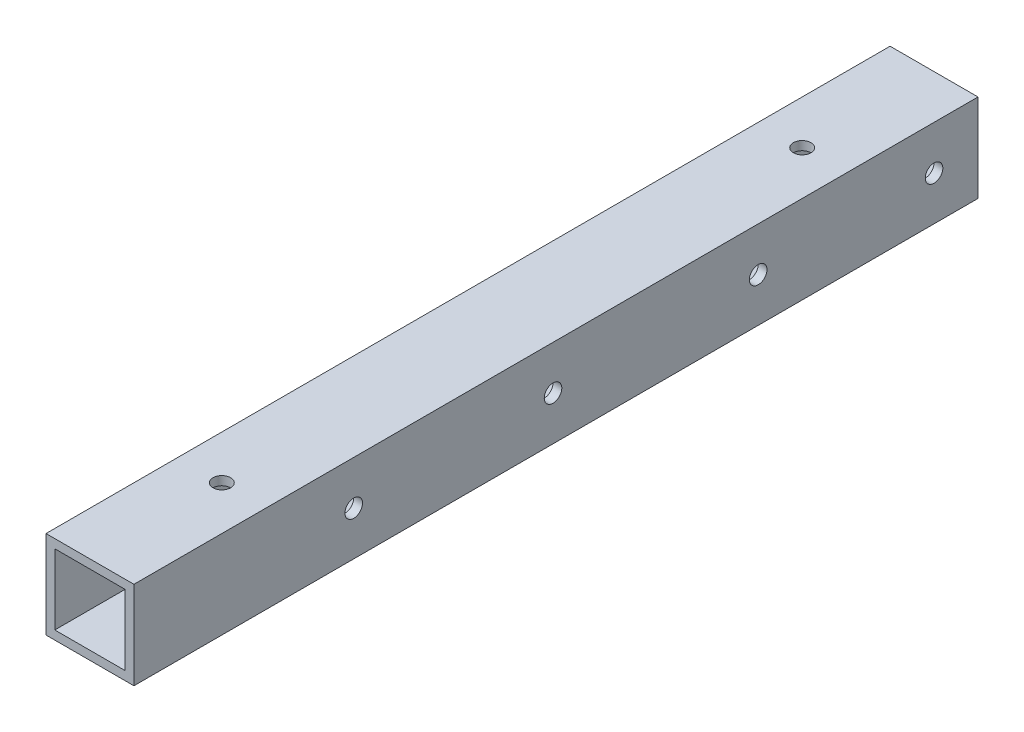
ISO-10303-21;
HEADER;
FILE_DESCRIPTION(('STEP AP214'),'2;1');
FILE_NAME('part.step','',(''),(''),'','','');
FILE_SCHEMA(('AUTOMOTIVE_DESIGN { 1 0 10303 214 1 1 1 1 }'));
ENDSEC;
DATA;
#1=APPLICATION_CONTEXT('core data for automotive mechanical design processes');
#2=APPLICATION_PROTOCOL_DEFINITION('international standard','automotive_design',2000,#1);
#3=PRODUCT_CONTEXT('',#1,'mechanical');
#4=PRODUCT('Part','Part','',(#3));
#5=PRODUCT_RELATED_PRODUCT_CATEGORY('part','',(#4));
#6=PRODUCT_DEFINITION_FORMATION('','',#4);
#7=PRODUCT_DEFINITION_CONTEXT('part definition',#1,'design');
#8=PRODUCT_DEFINITION('design','',#6,#7);
#9=PRODUCT_DEFINITION_SHAPE('','',#8);
#10=(LENGTH_UNIT() NAMED_UNIT(*) SI_UNIT(.MILLI.,.METRE.));
#11=(NAMED_UNIT(*) PLANE_ANGLE_UNIT() SI_UNIT($,.RADIAN.));
#12=(NAMED_UNIT(*) SI_UNIT($,.STERADIAN.) SOLID_ANGLE_UNIT());
#13=UNCERTAINTY_MEASURE_WITH_UNIT(LENGTH_MEASURE(1.E-05),#10,'distance_accuracy_value','');
#14=(GEOMETRIC_REPRESENTATION_CONTEXT(3) GLOBAL_UNCERTAINTY_ASSIGNED_CONTEXT((#13)) GLOBAL_UNIT_ASSIGNED_CONTEXT((#10,
#11,#12)) REPRESENTATION_CONTEXT('',''));
#15=CARTESIAN_POINT('',(0.,0.,0.));
#16=DIRECTION('',(0.,0.,1.));
#17=DIRECTION('',(1.,0.,0.));
#18=AXIS2_PLACEMENT_3D('',#15,#16,#17);
#19=CARTESIAN_POINT('',(-5.51008414074451,6.23262608579252,144.));
#20=DIRECTION('',(1.,0.,0.));
#21=DIRECTION('',(0.,1.,0.));
#22=AXIS2_PLACEMENT_3D('',#19,#20,#21);
#23=PLANE('',#22);
#24=CARTESIAN_POINT('',(-5.51008414074451,0.232626085792519,106.5));
#25=DIRECTION('',(1.,0.,0.));
#26=DIRECTION('',(0.,1.,0.));
#27=AXIS2_PLACEMENT_3D('',#24,#25,#26);
#28=CIRCLE('',#27,6.);
#29=CARTESIAN_POINT('',(-5.51008414074451,6.23262608579252,106.5));
#30=VERTEX_POINT('',#29);
#31=CARTESIAN_POINT('',(-5.51008414074451,-5.76737391420748,106.5));
#32=VERTEX_POINT('',#31);
#33=EDGE_CURVE('E51',#30,#32,#28,.T.);
#34=ORIENTED_EDGE('',*,*,#33,.F.);
#35=DIRECTION('',(0.,0.,-1.));
#36=VECTOR('',#35,1.);
#37=CARTESIAN_POINT('',(-5.51008414074451,6.23262608579252,144.));
#38=LINE('',#37,#36);
#39=CARTESIAN_POINT('',(-5.51008414074451,6.23262608579252,144.));
#40=VERTEX_POINT('',#39);
#41=EDGE_CURVE('E122',#40,#30,#38,.T.);
#42=ORIENTED_EDGE('',*,*,#41,.F.);
#43=DIRECTION('',(0.,-1.,0.));
#44=VECTOR('',#43,1.);
#45=CARTESIAN_POINT('',(-5.51008414074451,6.23262608579252,144.));
#46=LINE('',#45,#44);
#47=CARTESIAN_POINT('',(-5.51008414074451,-5.76737391420748,144.));
#48=VERTEX_POINT('',#47);
#49=EDGE_CURVE('E163',#40,#48,#46,.T.);
#50=ORIENTED_EDGE('',*,*,#49,.T.);
#51=DIRECTION('',(0.,0.,-1.));
#52=VECTOR('',#51,1.);
#53=CARTESIAN_POINT('',(-5.51008414074451,-5.76737391420748,144.));
#54=LINE('',#53,#52);
#55=EDGE_CURVE('E125',#48,#32,#54,.T.);
#56=ORIENTED_EDGE('',*,*,#55,.T.);
#57=EDGE_LOOP('',(#34,#42,#50,#56));
#58=FACE_BOUND('',#57,.T.);
#59=ADVANCED_FACE('F35',(#58),#23,.T.);
#60=EDGE_CURVE('E112',#32,#30,#28,.T.);
#61=ORIENTED_EDGE('',*,*,#60,.F.);
#62=CARTESIAN_POINT('',(-5.51008414074451,-5.76737391420748,37.5));
#63=VERTEX_POINT('',#62);
#64=EDGE_CURVE('E58',#32,#63,#54,.T.);
#65=ORIENTED_EDGE('',*,*,#64,.T.);
#66=CARTESIAN_POINT('',(-5.51008414074451,0.232626085792519,37.5));
#67=DIRECTION('',(1.,0.,0.));
#68=DIRECTION('',(0.,1.,0.));
#69=AXIS2_PLACEMENT_3D('',#66,#67,#68);
#70=CIRCLE('',#69,5.99999999999999);
#71=CARTESIAN_POINT('',(-5.51008414074451,6.23262608579252,37.5));
#72=VERTEX_POINT('',#71);
#73=EDGE_CURVE('E129',#72,#63,#70,.T.);
#74=ORIENTED_EDGE('',*,*,#73,.F.);
#75=EDGE_CURVE('E127',#30,#72,#38,.T.);
#76=ORIENTED_EDGE('',*,*,#75,.F.);
#77=EDGE_LOOP('',(#61,#65,#74,#76));
#78=FACE_BOUND('',#77,.T.);
#79=ADVANCED_FACE('F128',(#78),#23,.T.);
#80=CARTESIAN_POINT('',(0.,0.,144.));
#81=DIRECTION('',(0.,0.,1.));
#82=DIRECTION('',(1.,0.,0.));
#83=AXIS2_PLACEMENT_3D('',#80,#81,#82);
#84=PLANE('',#83);
#85=DIRECTION('',(0.,-1.,0.));
#86=VECTOR('',#85,1.);
#87=CARTESIAN_POINT('',(-7.01008414074451,7.73262608579252,144.));
#88=LINE('',#87,#86);
#89=CARTESIAN_POINT('',(-7.01008414074451,7.73262608579252,144.));
#90=VERTEX_POINT('',#89);
#91=CARTESIAN_POINT('',(-7.01008414074451,-7.26737391420748,144.));
#92=VERTEX_POINT('',#91);
#93=EDGE_CURVE('E241',#90,#92,#88,.T.);
#94=ORIENTED_EDGE('',*,*,#93,.T.);
#95=DIRECTION('',(1.,0.,0.));
#96=VECTOR('',#95,1.);
#97=CARTESIAN_POINT('',(-7.01008414074451,-7.26737391420748,144.));
#98=LINE('',#97,#96);
#99=CARTESIAN_POINT('',(7.98991585925548,-7.26737391420748,144.));
#100=VERTEX_POINT('',#99);
#101=EDGE_CURVE('E244',#92,#100,#98,.T.);
#102=ORIENTED_EDGE('',*,*,#101,.T.);
#103=DIRECTION('',(0.,1.,0.));
#104=VECTOR('',#103,1.);
#105=CARTESIAN_POINT('',(7.98991585925549,7.73262608579252,144.));
#106=LINE('',#105,#104);
#107=CARTESIAN_POINT('',(7.98991585925549,7.73262608579252,144.));
#108=VERTEX_POINT('',#107);
#109=EDGE_CURVE('E247',#100,#108,#106,.T.);
#110=ORIENTED_EDGE('',*,*,#109,.T.);
#111=DIRECTION('',(-1.,0.,0.));
#112=VECTOR('',#111,1.);
#113=CARTESIAN_POINT('',(-7.01008414074451,7.73262608579252,144.));
#114=LINE('',#113,#112);
#115=EDGE_CURVE('E249',#108,#90,#114,.T.);
#116=ORIENTED_EDGE('',*,*,#115,.T.);
#117=EDGE_LOOP('',(#94,#102,#110,#116));
#118=FACE_BOUND('',#117,.T.);
#119=DIRECTION('',(1.,0.,0.));
#120=VECTOR('',#119,1.);
#121=CARTESIAN_POINT('',(-5.51008414074451,-5.76737391420748,144.));
#122=LINE('',#121,#120);
#123=CARTESIAN_POINT('',(6.48991585925549,-5.76737391420748,144.));
#124=VERTEX_POINT('',#123);
#125=EDGE_CURVE('E148',#48,#124,#122,.T.);
#126=ORIENTED_EDGE('',*,*,#125,.F.);
#127=ORIENTED_EDGE('',*,*,#49,.F.);
#128=DIRECTION('',(-1.,0.,0.));
#129=VECTOR('',#128,1.);
#130=CARTESIAN_POINT('',(-5.51008414074451,6.23262608579252,144.));
#131=LINE('',#130,#129);
#132=CARTESIAN_POINT('',(6.48991585925549,6.23262608579252,144.));
#133=VERTEX_POINT('',#132);
#134=EDGE_CURVE('E138',#133,#40,#131,.T.);
#135=ORIENTED_EDGE('',*,*,#134,.F.);
#136=DIRECTION('',(0.,1.,0.));
#137=VECTOR('',#136,1.);
#138=CARTESIAN_POINT('',(6.48991585925549,6.23262608579252,144.));
#139=LINE('',#138,#137);
#140=EDGE_CURVE('E145',#124,#133,#139,.T.);
#141=ORIENTED_EDGE('',*,*,#140,.F.);
#142=EDGE_LOOP('',(#126,#127,#135,#141));
#143=FACE_BOUND('',#142,.T.);
#144=ADVANCED_FACE('F310',(#118,#143),#84,.T.);
#145=CARTESIAN_POINT('',(0.,0.,0.));
#146=DIRECTION('',(0.,0.,1.));
#147=DIRECTION('',(1.,0.,0.));
#148=AXIS2_PLACEMENT_3D('',#145,#146,#147);
#149=PLANE('',#148);
#150=DIRECTION('',(0.,-1.,0.));
#151=VECTOR('',#150,1.);
#152=CARTESIAN_POINT('',(-7.01008414074451,7.73262608579252,0.));
#153=LINE('',#152,#151);
#154=CARTESIAN_POINT('',(-7.01008414074451,7.73262608579252,0.));
#155=VERTEX_POINT('',#154);
#156=CARTESIAN_POINT('',(-7.01008414074451,-7.26737391420748,0.));
#157=VERTEX_POINT('',#156);
#158=EDGE_CURVE('E240',#155,#157,#153,.T.);
#159=ORIENTED_EDGE('',*,*,#158,.F.);
#160=DIRECTION('',(-1.,0.,0.));
#161=VECTOR('',#160,1.);
#162=CARTESIAN_POINT('',(-7.01008414074451,7.73262608579252,0.));
#163=LINE('',#162,#161);
#164=CARTESIAN_POINT('',(7.98991585925549,7.73262608579252,0.));
#165=VERTEX_POINT('',#164);
#166=EDGE_CURVE('E245',#165,#155,#163,.T.);
#167=ORIENTED_EDGE('',*,*,#166,.F.);
#168=DIRECTION('',(0.,1.,0.));
#169=VECTOR('',#168,1.);
#170=CARTESIAN_POINT('',(7.98991585925549,7.73262608579252,0.));
#171=LINE('',#170,#169);
#172=CARTESIAN_POINT('',(7.98991585925548,-7.26737391420748,0.));
#173=VERTEX_POINT('',#172);
#174=EDGE_CURVE('E256',#173,#165,#171,.T.);
#175=ORIENTED_EDGE('',*,*,#174,.F.);
#176=DIRECTION('',(1.,0.,0.));
#177=VECTOR('',#176,1.);
#178=CARTESIAN_POINT('',(-7.01008414074451,-7.26737391420748,0.));
#179=LINE('',#178,#177);
#180=EDGE_CURVE('E254',#157,#173,#179,.T.);
#181=ORIENTED_EDGE('',*,*,#180,.F.);
#182=EDGE_LOOP('',(#159,#167,#175,#181));
#183=FACE_BOUND('',#182,.T.);
#184=DIRECTION('',(0.,-1.,0.));
#185=VECTOR('',#184,1.);
#186=CARTESIAN_POINT('',(-5.51008414074451,6.23262608579252,0.));
#187=LINE('',#186,#185);
#188=CARTESIAN_POINT('',(-5.51008414074451,6.23262608579252,0.));
#189=VERTEX_POINT('',#188);
#190=CARTESIAN_POINT('',(-5.51008414074451,-5.76737391420748,0.));
#191=VERTEX_POINT('',#190);
#192=EDGE_CURVE('E152',#189,#191,#187,.T.);
#193=ORIENTED_EDGE('',*,*,#192,.T.);
#194=DIRECTION('',(1.,0.,0.));
#195=VECTOR('',#194,1.);
#196=CARTESIAN_POINT('',(-5.51008414074451,-5.76737391420748,0.));
#197=LINE('',#196,#195);
#198=CARTESIAN_POINT('',(6.48991585925549,-5.76737391420748,0.));
#199=VERTEX_POINT('',#198);
#200=EDGE_CURVE('E155',#191,#199,#197,.T.);
#201=ORIENTED_EDGE('',*,*,#200,.T.);
#202=DIRECTION('',(0.,1.,0.));
#203=VECTOR('',#202,1.);
#204=CARTESIAN_POINT('',(6.48991585925549,6.23262608579252,0.));
#205=LINE('',#204,#203);
#206=CARTESIAN_POINT('',(6.48991585925549,6.23262608579252,0.));
#207=VERTEX_POINT('',#206);
#208=EDGE_CURVE('E159',#199,#207,#205,.T.);
#209=ORIENTED_EDGE('',*,*,#208,.T.);
#210=DIRECTION('',(-1.,0.,0.));
#211=VECTOR('',#210,1.);
#212=CARTESIAN_POINT('',(-5.51008414074451,6.23262608579252,0.));
#213=LINE('',#212,#211);
#214=EDGE_CURVE('E161',#207,#189,#213,.T.);
#215=ORIENTED_EDGE('',*,*,#214,.T.);
#216=EDGE_LOOP('',(#193,#201,#209,#215));
#217=FACE_BOUND('',#216,.T.);
#218=ADVANCED_FACE('F231',(#183,#217),#149,.F.);
#219=CARTESIAN_POINT('',(-7.01008414074451,7.73262608579252,144.));
#220=DIRECTION('',(1.,0.,0.));
#221=DIRECTION('',(0.,1.,0.));
#222=AXIS2_PLACEMENT_3D('',#219,#220,#221);
#223=PLANE('',#222);
#224=CARTESIAN_POINT('',(-7.01008414074451,0.232626085792519,106.5));
#225=DIRECTION('',(-1.,0.,0.));
#226=DIRECTION('',(0.,-1.,0.));
#227=AXIS2_PLACEMENT_3D('',#224,#225,#226);
#228=CIRCLE('',#227,6.);
#229=CARTESIAN_POINT('',(-7.01008414074451,-5.76737391420748,106.5));
#230=VERTEX_POINT('',#229);
#231=EDGE_CURVE('E116',#230,#230,#228,.T.);
#232=ORIENTED_EDGE('',*,*,#231,.F.);
#233=EDGE_LOOP('',(#232));
#234=FACE_BOUND('',#233,.T.);
#235=CARTESIAN_POINT('',(-7.01008414074451,0.232626085792518,37.5));
#236=DIRECTION('',(-1.,0.,0.));
#237=DIRECTION('',(0.,-1.,0.));
#238=AXIS2_PLACEMENT_3D('',#235,#236,#237);
#239=CIRCLE('',#238,5.99999999999999);
#240=CARTESIAN_POINT('',(-7.01008414074451,-5.76737391420748,37.5));
#241=VERTEX_POINT('',#240);
#242=EDGE_CURVE('E184',#241,#241,#239,.T.);
#243=ORIENTED_EDGE('',*,*,#242,.F.);
#244=EDGE_LOOP('',(#243));
#245=FACE_BOUND('',#244,.T.);
#246=ORIENTED_EDGE('',*,*,#158,.T.);
#247=DIRECTION('',(0.,0.,-1.));
#248=VECTOR('',#247,1.);
#249=CARTESIAN_POINT('',(-7.01008414074451,-7.26737391420748,144.));
#250=LINE('',#249,#248);
#251=EDGE_CURVE('E11',#92,#157,#250,.T.);
#252=ORIENTED_EDGE('',*,*,#251,.F.);
#253=ORIENTED_EDGE('',*,*,#93,.F.);
#254=DIRECTION('',(0.,0.,-1.));
#255=VECTOR('',#254,1.);
#256=CARTESIAN_POINT('',(-7.01008414074451,7.73262608579252,144.));
#257=LINE('',#256,#255);
#258=EDGE_CURVE('E251',#90,#155,#257,.T.);
#259=ORIENTED_EDGE('',*,*,#258,.T.);
#260=EDGE_LOOP('',(#246,#252,#253,#259));
#261=FACE_BOUND('',#260,.T.);
#262=ADVANCED_FACE('F37',(#234,#245,#261),#223,.F.);
#263=CARTESIAN_POINT('',(-7.01008414074451,-7.26737391420748,144.));
#264=DIRECTION('',(0.,1.,0.));
#265=DIRECTION('',(0.,0.,1.));
#266=AXIS2_PLACEMENT_3D('',#263,#264,#265);
#267=PLANE('',#266);
#268=CARTESIAN_POINT('',(0.489915859255483,-7.26737391420748,72.5));
#269=DIRECTION('',(0.,-1.,0.));
#270=DIRECTION('',(0.,0.,-1.));
#271=AXIS2_PLACEMENT_3D('',#268,#269,#270);
#272=CIRCLE('',#271,4.);
#273=CARTESIAN_POINT('',(0.489915859255483,-7.26737391420748,68.5));
#274=VERTEX_POINT('',#273);
#275=EDGE_CURVE('E126',#274,#274,#272,.T.);
#276=ORIENTED_EDGE('',*,*,#275,.F.);
#277=EDGE_LOOP('',(#276));
#278=FACE_BOUND('',#277,.T.);
#279=CARTESIAN_POINT('',(0.489915859255488,-7.26737391420748,121.5));
#280=DIRECTION('',(0.,-1.,0.));
#281=DIRECTION('',(0.,0.,-1.));
#282=AXIS2_PLACEMENT_3D('',#279,#280,#281);
#283=CIRCLE('',#282,4.);
#284=CARTESIAN_POINT('',(0.489915859255488,-7.26737391420748,117.5));
#285=VERTEX_POINT('',#284);
#286=EDGE_CURVE('E179',#285,#285,#283,.T.);
#287=ORIENTED_EDGE('',*,*,#286,.F.);
#288=EDGE_LOOP('',(#287));
#289=FACE_BOUND('',#288,.T.);
#290=CARTESIAN_POINT('',(0.489915859255486,-7.26737391420748,22.5));
#291=DIRECTION('',(0.,-1.,0.));
#292=DIRECTION('',(0.,0.,-1.));
#293=AXIS2_PLACEMENT_3D('',#290,#291,#292);
#294=CIRCLE('',#293,4.);
#295=CARTESIAN_POINT('',(0.489915859255486,-7.26737391420748,18.5));
#296=VERTEX_POINT('',#295);
#297=EDGE_CURVE('E175',#296,#296,#294,.T.);
#298=ORIENTED_EDGE('',*,*,#297,.F.);
#299=EDGE_LOOP('',(#298));
#300=FACE_BOUND('',#299,.T.);
#301=ORIENTED_EDGE('',*,*,#180,.T.);
#302=DIRECTION('',(0.,0.,-1.));
#303=VECTOR('',#302,1.);
#304=CARTESIAN_POINT('',(7.98991585925548,-7.26737391420748,144.));
#305=LINE('',#304,#303);
#306=EDGE_CURVE('E44',#100,#173,#305,.T.);
#307=ORIENTED_EDGE('',*,*,#306,.F.);
#308=ORIENTED_EDGE('',*,*,#101,.F.);
#309=ORIENTED_EDGE('',*,*,#251,.T.);
#310=EDGE_LOOP('',(#301,#307,#308,#309));
#311=FACE_BOUND('',#310,.T.);
#312=ADVANCED_FACE('F289',(#278,#289,#300,#311),#267,.F.);
#313=CARTESIAN_POINT('',(7.98991585925549,7.73262608579252,144.));
#314=DIRECTION('',(-1.,0.,0.));
#315=DIRECTION('',(0.,-1.,0.));
#316=AXIS2_PLACEMENT_3D('',#313,#314,#315);
#317=PLANE('',#316);
#318=CARTESIAN_POINT('',(7.98991585925548,0.232626085792518,72.5));
#319=DIRECTION('',(1.,0.,0.));
#320=DIRECTION('',(0.,1.,0.));
#321=AXIS2_PLACEMENT_3D('',#318,#319,#320);
#322=CIRCLE('',#321,1.5);
#323=CARTESIAN_POINT('',(7.98991585925548,1.73262608579252,72.5));
#324=VERTEX_POINT('',#323);
#325=EDGE_CURVE('E204',#324,#324,#322,.T.);
#326=ORIENTED_EDGE('',*,*,#325,.F.);
#327=EDGE_LOOP('',(#326));
#328=FACE_BOUND('',#327,.T.);
#329=CARTESIAN_POINT('',(7.98991585925548,0.232626085792518,7.5));
#330=DIRECTION('',(1.,0.,0.));
#331=DIRECTION('',(0.,1.,0.));
#332=AXIS2_PLACEMENT_3D('',#329,#330,#331);
#333=CIRCLE('',#332,1.5);
#334=CARTESIAN_POINT('',(7.98991585925548,1.73262608579252,7.5));
#335=VERTEX_POINT('',#334);
#336=EDGE_CURVE('E201',#335,#335,#333,.T.);
#337=ORIENTED_EDGE('',*,*,#336,.F.);
#338=EDGE_LOOP('',(#337));
#339=FACE_BOUND('',#338,.T.);
#340=CARTESIAN_POINT('',(7.98991585925548,0.232626085792518,106.5));
#341=DIRECTION('',(1.,0.,0.));
#342=DIRECTION('',(0.,1.,0.));
#343=AXIS2_PLACEMENT_3D('',#340,#341,#342);
#344=CIRCLE('',#343,1.5);
#345=CARTESIAN_POINT('',(7.98991585925548,1.73262608579252,106.5));
#346=VERTEX_POINT('',#345);
#347=EDGE_CURVE('E197',#346,#346,#344,.T.);
#348=ORIENTED_EDGE('',*,*,#347,.F.);
#349=EDGE_LOOP('',(#348));
#350=FACE_BOUND('',#349,.T.);
#351=CARTESIAN_POINT('',(7.98991585925548,0.232626085792518,37.5));
#352=DIRECTION('',(1.,0.,0.));
#353=DIRECTION('',(0.,1.,0.));
#354=AXIS2_PLACEMENT_3D('',#351,#352,#353);
#355=CIRCLE('',#354,1.5);
#356=CARTESIAN_POINT('',(7.98991585925548,1.73262608579252,37.5));
#357=VERTEX_POINT('',#356);
#358=EDGE_CURVE('E188',#357,#357,#355,.T.);
#359=ORIENTED_EDGE('',*,*,#358,.F.);
#360=EDGE_LOOP('',(#359));
#361=FACE_BOUND('',#360,.T.);
#362=ORIENTED_EDGE('',*,*,#174,.T.);
#363=DIRECTION('',(0.,0.,-1.));
#364=VECTOR('',#363,1.);
#365=CARTESIAN_POINT('',(7.98991585925549,7.73262608579252,144.));
#366=LINE('',#365,#364);
#367=EDGE_CURVE('E261',#108,#165,#366,.T.);
#368=ORIENTED_EDGE('',*,*,#367,.F.);
#369=ORIENTED_EDGE('',*,*,#109,.F.);
#370=ORIENTED_EDGE('',*,*,#306,.T.);
#371=EDGE_LOOP('',(#362,#368,#369,#370));
#372=FACE_BOUND('',#371,.T.);
#373=ADVANCED_FACE('F285',(#328,#339,#350,#361,#372),#317,.F.);
#374=CARTESIAN_POINT('',(-7.01008414074451,7.73262608579252,144.));
#375=DIRECTION('',(0.,-1.,0.));
#376=DIRECTION('',(0.,0.,-1.));
#377=AXIS2_PLACEMENT_3D('',#374,#375,#376);
#378=PLANE('',#377);
#379=CARTESIAN_POINT('',(0.489915859255486,7.73262608579252,121.5));
#380=DIRECTION('',(0.,1.,0.));
#381=DIRECTION('',(0.,0.,1.));
#382=AXIS2_PLACEMENT_3D('',#379,#380,#381);
#383=CIRCLE('',#382,1.5);
#384=CARTESIAN_POINT('',(0.489915859255486,7.73262608579252,123.));
#385=VERTEX_POINT('',#384);
#386=EDGE_CURVE('E171',#385,#385,#383,.T.);
#387=ORIENTED_EDGE('',*,*,#386,.F.);
#388=EDGE_LOOP('',(#387));
#389=FACE_BOUND('',#388,.T.);
#390=CARTESIAN_POINT('',(0.489915859255486,7.73262608579252,22.5));
#391=DIRECTION('',(0.,1.,0.));
#392=DIRECTION('',(0.,0.,1.));
#393=AXIS2_PLACEMENT_3D('',#390,#391,#392);
#394=CIRCLE('',#393,1.5);
#395=CARTESIAN_POINT('',(0.489915859255486,7.73262608579252,24.));
#396=VERTEX_POINT('',#395);
#397=EDGE_CURVE('E167',#396,#396,#394,.T.);
#398=ORIENTED_EDGE('',*,*,#397,.F.);
#399=EDGE_LOOP('',(#398));
#400=FACE_BOUND('',#399,.T.);
#401=ORIENTED_EDGE('',*,*,#166,.T.);
#402=ORIENTED_EDGE('',*,*,#258,.F.);
#403=ORIENTED_EDGE('',*,*,#115,.F.);
#404=ORIENTED_EDGE('',*,*,#367,.T.);
#405=EDGE_LOOP('',(#401,#402,#403,#404));
#406=FACE_BOUND('',#405,.T.);
#407=ADVANCED_FACE('F288',(#389,#400,#406),#378,.F.);
#408=EDGE_CURVE('E182',#63,#72,#70,.T.);
#409=ORIENTED_EDGE('',*,*,#408,.F.);
#410=EDGE_CURVE('E235',#63,#191,#54,.T.);
#411=ORIENTED_EDGE('',*,*,#410,.T.);
#412=ORIENTED_EDGE('',*,*,#192,.F.);
#413=EDGE_CURVE('E133',#72,#189,#38,.T.);
#414=ORIENTED_EDGE('',*,*,#413,.F.);
#415=EDGE_LOOP('',(#409,#411,#412,#414));
#416=FACE_BOUND('',#415,.T.);
#417=ADVANCED_FACE('F323',(#416),#23,.T.);
#418=CARTESIAN_POINT('',(-5.51008414074451,-5.76737391420748,144.));
#419=DIRECTION('',(0.,1.,0.));
#420=DIRECTION('',(0.,0.,1.));
#421=AXIS2_PLACEMENT_3D('',#418,#419,#420);
#422=PLANE('',#421);
#423=ORIENTED_EDGE('',*,*,#64,.F.);
#424=ORIENTED_EDGE('',*,*,#55,.F.);
#425=ORIENTED_EDGE('',*,*,#125,.T.);
#426=DIRECTION('',(0.,0.,-1.));
#427=VECTOR('',#426,1.);
#428=CARTESIAN_POINT('',(6.48991585925549,-5.76737391420748,144.));
#429=LINE('',#428,#427);
#430=EDGE_CURVE('E140',#124,#199,#429,.T.);
#431=ORIENTED_EDGE('',*,*,#430,.T.);
#432=ORIENTED_EDGE('',*,*,#200,.F.);
#433=ORIENTED_EDGE('',*,*,#410,.F.);
#434=EDGE_LOOP('',(#423,#424,#425,#431,#432,#433));
#435=FACE_BOUND('',#434,.T.);
#436=CARTESIAN_POINT('',(0.489915859255483,-5.76737391420748,72.5));
#437=DIRECTION('',(0.,1.,0.));
#438=DIRECTION('',(0.,0.,1.));
#439=AXIS2_PLACEMENT_3D('',#436,#437,#438);
#440=CIRCLE('',#439,4.);
#441=CARTESIAN_POINT('',(0.489915859255483,-5.76737391420748,76.5));
#442=VERTEX_POINT('',#441);
#443=EDGE_CURVE('E191',#442,#442,#440,.T.);
#444=ORIENTED_EDGE('',*,*,#443,.F.);
#445=EDGE_LOOP('',(#444));
#446=FACE_BOUND('',#445,.T.);
#447=CARTESIAN_POINT('',(0.489915859255488,-5.76737391420748,121.5));
#448=DIRECTION('',(0.,1.,0.));
#449=DIRECTION('',(0.,0.,1.));
#450=AXIS2_PLACEMENT_3D('',#447,#448,#449);
#451=CIRCLE('',#450,4.);
#452=CARTESIAN_POINT('',(0.489915859255488,-5.76737391420748,125.5));
#453=VERTEX_POINT('',#452);
#454=EDGE_CURVE('E178',#453,#453,#451,.T.);
#455=ORIENTED_EDGE('',*,*,#454,.F.);
#456=EDGE_LOOP('',(#455));
#457=FACE_BOUND('',#456,.T.);
#458=CARTESIAN_POINT('',(0.489915859255486,-5.76737391420748,22.5));
#459=DIRECTION('',(0.,1.,0.));
#460=DIRECTION('',(0.,0.,1.));
#461=AXIS2_PLACEMENT_3D('',#458,#459,#460);
#462=CIRCLE('',#461,4.);
#463=CARTESIAN_POINT('',(0.489915859255486,-5.76737391420748,26.5));
#464=VERTEX_POINT('',#463);
#465=EDGE_CURVE('E174',#464,#464,#462,.T.);
#466=ORIENTED_EDGE('',*,*,#465,.F.);
#467=EDGE_LOOP('',(#466));
#468=FACE_BOUND('',#467,.T.);
#469=ADVANCED_FACE('F216',(#435,#446,#457,#468),#422,.T.);
#470=CARTESIAN_POINT('',(6.48991585925549,6.23262608579252,144.));
#471=DIRECTION('',(-1.,0.,0.));
#472=DIRECTION('',(0.,-1.,0.));
#473=AXIS2_PLACEMENT_3D('',#470,#471,#472);
#474=PLANE('',#473);
#475=CARTESIAN_POINT('',(6.48991585925549,0.232626085792519,72.5));
#476=DIRECTION('',(-1.,0.,0.));
#477=DIRECTION('',(0.,-1.,0.));
#478=AXIS2_PLACEMENT_3D('',#475,#476,#477);
#479=CIRCLE('',#478,1.5);
#480=CARTESIAN_POINT('',(6.48991585925549,-1.26737391420748,72.5));
#481=VERTEX_POINT('',#480);
#482=EDGE_CURVE('E39',#481,#481,#479,.T.);
#483=ORIENTED_EDGE('',*,*,#482,.F.);
#484=EDGE_LOOP('',(#483));
#485=FACE_BOUND('',#484,.T.);
#486=CARTESIAN_POINT('',(6.48991585925549,0.232626085792518,7.5));
#487=DIRECTION('',(-1.,0.,0.));
#488=DIRECTION('',(0.,-1.,0.));
#489=AXIS2_PLACEMENT_3D('',#486,#487,#488);
#490=CIRCLE('',#489,1.5);
#491=CARTESIAN_POINT('',(6.48991585925549,-1.26737391420748,7.5));
#492=VERTEX_POINT('',#491);
#493=EDGE_CURVE('E200',#492,#492,#490,.T.);
#494=ORIENTED_EDGE('',*,*,#493,.F.);
#495=EDGE_LOOP('',(#494));
#496=FACE_BOUND('',#495,.T.);
#497=CARTESIAN_POINT('',(6.48991585925549,0.232626085792519,106.5));
#498=DIRECTION('',(-1.,0.,0.));
#499=DIRECTION('',(0.,-1.,0.));
#500=AXIS2_PLACEMENT_3D('',#497,#498,#499);
#501=CIRCLE('',#500,1.5);
#502=CARTESIAN_POINT('',(6.48991585925549,-1.26737391420748,106.5));
#503=VERTEX_POINT('',#502);
#504=EDGE_CURVE('E196',#503,#503,#501,.T.);
#505=ORIENTED_EDGE('',*,*,#504,.F.);
#506=EDGE_LOOP('',(#505));
#507=FACE_BOUND('',#506,.T.);
#508=CARTESIAN_POINT('',(6.48991585925549,0.232626085792519,37.5));
#509=DIRECTION('',(-1.,0.,0.));
#510=DIRECTION('',(0.,-1.,0.));
#511=AXIS2_PLACEMENT_3D('',#508,#509,#510);
#512=CIRCLE('',#511,1.5);
#513=CARTESIAN_POINT('',(6.48991585925549,-1.26737391420749,37.5));
#514=VERTEX_POINT('',#513);
#515=EDGE_CURVE('E187',#514,#514,#512,.T.);
#516=ORIENTED_EDGE('',*,*,#515,.F.);
#517=EDGE_LOOP('',(#516));
#518=FACE_BOUND('',#517,.T.);
#519=ORIENTED_EDGE('',*,*,#208,.F.);
#520=ORIENTED_EDGE('',*,*,#430,.F.);
#521=ORIENTED_EDGE('',*,*,#140,.T.);
#522=DIRECTION('',(0.,0.,-1.));
#523=VECTOR('',#522,1.);
#524=CARTESIAN_POINT('',(6.48991585925549,6.23262608579252,144.));
#525=LINE('',#524,#523);
#526=EDGE_CURVE('E139',#133,#207,#525,.T.);
#527=ORIENTED_EDGE('',*,*,#526,.T.);
#528=EDGE_LOOP('',(#519,#520,#521,#527));
#529=FACE_BOUND('',#528,.T.);
#530=ADVANCED_FACE('F213',(#485,#496,#507,#518,#529),#474,.T.);
#531=CARTESIAN_POINT('',(-5.51008414074451,6.23262608579252,144.));
#532=DIRECTION('',(0.,-1.,0.));
#533=DIRECTION('',(0.,0.,-1.));
#534=AXIS2_PLACEMENT_3D('',#531,#532,#533);
#535=PLANE('',#534);
#536=ORIENTED_EDGE('',*,*,#41,.T.);
#537=ORIENTED_EDGE('',*,*,#75,.T.);
#538=ORIENTED_EDGE('',*,*,#413,.T.);
#539=ORIENTED_EDGE('',*,*,#214,.F.);
#540=ORIENTED_EDGE('',*,*,#526,.F.);
#541=ORIENTED_EDGE('',*,*,#134,.T.);
#542=EDGE_LOOP('',(#536,#537,#538,#539,#540,#541));
#543=FACE_BOUND('',#542,.T.);
#544=CARTESIAN_POINT('',(0.489915859255486,6.23262608579252,121.5));
#545=DIRECTION('',(0.,-1.,0.));
#546=DIRECTION('',(0.,0.,-1.));
#547=AXIS2_PLACEMENT_3D('',#544,#545,#546);
#548=CIRCLE('',#547,1.5);
#549=CARTESIAN_POINT('',(0.489915859255486,6.23262608579252,120.));
#550=VERTEX_POINT('',#549);
#551=EDGE_CURVE('E170',#550,#550,#548,.T.);
#552=ORIENTED_EDGE('',*,*,#551,.F.);
#553=EDGE_LOOP('',(#552));
#554=FACE_BOUND('',#553,.T.);
#555=CARTESIAN_POINT('',(0.489915859255486,6.23262608579252,22.5));
#556=DIRECTION('',(0.,-1.,0.));
#557=DIRECTION('',(0.,0.,-1.));
#558=AXIS2_PLACEMENT_3D('',#555,#556,#557);
#559=CIRCLE('',#558,1.5);
#560=CARTESIAN_POINT('',(0.489915859255486,6.23262608579252,21.));
#561=VERTEX_POINT('',#560);
#562=EDGE_CURVE('E156',#561,#561,#559,.T.);
#563=ORIENTED_EDGE('',*,*,#562,.F.);
#564=EDGE_LOOP('',(#563));
#565=FACE_BOUND('',#564,.T.);
#566=ADVANCED_FACE('F135',(#543,#554,#565),#535,.T.);
#567=CARTESIAN_POINT('',(0.489915859255486,-2.26737391420748,22.5));
#568=DIRECTION('',(0.,1.,0.));
#569=DIRECTION('',(0.,0.,1.));
#570=AXIS2_PLACEMENT_3D('',#567,#568,#569);
#571=CYLINDRICAL_SURFACE('',#570,1.5);
#572=ORIENTED_EDGE('',*,*,#562,.T.);
#573=EDGE_LOOP('',(#572));
#574=FACE_BOUND('',#573,.T.);
#575=ORIENTED_EDGE('',*,*,#397,.T.);
#576=EDGE_LOOP('',(#575));
#577=FACE_BOUND('',#576,.T.);
#578=ADVANCED_FACE('F365',(#574,#577),#571,.F.);
#579=CARTESIAN_POINT('',(0.489915859255486,-2.26737391420748,121.5));
#580=DIRECTION('',(0.,1.,0.));
#581=DIRECTION('',(0.,0.,1.));
#582=AXIS2_PLACEMENT_3D('',#579,#580,#581);
#583=CYLINDRICAL_SURFACE('',#582,1.5);
#584=ORIENTED_EDGE('',*,*,#551,.T.);
#585=EDGE_LOOP('',(#584));
#586=FACE_BOUND('',#585,.T.);
#587=ORIENTED_EDGE('',*,*,#386,.T.);
#588=EDGE_LOOP('',(#587));
#589=FACE_BOUND('',#588,.T.);
#590=ADVANCED_FACE('F361',(#586,#589),#583,.F.);
#591=CARTESIAN_POINT('',(0.489915859255486,2.73262608579252,22.5));
#592=DIRECTION('',(0.,-1.,0.));
#593=DIRECTION('',(0.,0.,-1.));
#594=AXIS2_PLACEMENT_3D('',#591,#592,#593);
#595=CYLINDRICAL_SURFACE('',#594,4.);
#596=ORIENTED_EDGE('',*,*,#465,.T.);
#597=EDGE_LOOP('',(#596));
#598=FACE_BOUND('',#597,.T.);
#599=ORIENTED_EDGE('',*,*,#297,.T.);
#600=EDGE_LOOP('',(#599));
#601=FACE_BOUND('',#600,.T.);
#602=ADVANCED_FACE('F354',(#598,#601),#595,.F.);
#603=CARTESIAN_POINT('',(0.489915859255488,2.73262608579252,121.5));
#604=DIRECTION('',(0.,-1.,0.));
#605=DIRECTION('',(0.,0.,-1.));
#606=AXIS2_PLACEMENT_3D('',#603,#604,#605);
#607=CYLINDRICAL_SURFACE('',#606,4.);
#608=ORIENTED_EDGE('',*,*,#454,.T.);
#609=EDGE_LOOP('',(#608));
#610=FACE_BOUND('',#609,.T.);
#611=ORIENTED_EDGE('',*,*,#286,.T.);
#612=EDGE_LOOP('',(#611));
#613=FACE_BOUND('',#612,.T.);
#614=ADVANCED_FACE('F343',(#610,#613),#607,.F.);
#615=CARTESIAN_POINT('',(2.98991585925549,0.23262608579252,37.5));
#616=DIRECTION('',(-1.,0.,0.));
#617=DIRECTION('',(0.,-1.,0.));
#618=AXIS2_PLACEMENT_3D('',#615,#616,#617);
#619=CYLINDRICAL_SURFACE('',#618,5.99999999999999);
#620=ORIENTED_EDGE('',*,*,#73,.T.);
#621=ORIENTED_EDGE('',*,*,#408,.T.);
#622=EDGE_LOOP('',(#620,#621));
#623=FACE_BOUND('',#622,.T.);
#624=ORIENTED_EDGE('',*,*,#242,.T.);
#625=EDGE_LOOP('',(#624));
#626=FACE_BOUND('',#625,.T.);
#627=ADVANCED_FACE('F339',(#623,#626),#619,.F.);
#628=CARTESIAN_POINT('',(-2.01008414074452,0.232626085792521,37.5));
#629=DIRECTION('',(1.,0.,0.));
#630=DIRECTION('',(0.,1.,0.));
#631=AXIS2_PLACEMENT_3D('',#628,#629,#630);
#632=CYLINDRICAL_SURFACE('',#631,1.5);
#633=ORIENTED_EDGE('',*,*,#515,.T.);
#634=EDGE_LOOP('',(#633));
#635=FACE_BOUND('',#634,.T.);
#636=ORIENTED_EDGE('',*,*,#358,.T.);
#637=EDGE_LOOP('',(#636));
#638=FACE_BOUND('',#637,.T.);
#639=ADVANCED_FACE('F342',(#635,#638),#632,.F.);
#640=CARTESIAN_POINT('',(0.489915859255483,2.73262608579252,72.5));
#641=DIRECTION('',(0.,-1.,0.));
#642=DIRECTION('',(0.,0.,-1.));
#643=AXIS2_PLACEMENT_3D('',#640,#641,#642);
#644=CYLINDRICAL_SURFACE('',#643,4.);
#645=ORIENTED_EDGE('',*,*,#443,.T.);
#646=EDGE_LOOP('',(#645));
#647=FACE_BOUND('',#646,.T.);
#648=ORIENTED_EDGE('',*,*,#275,.T.);
#649=EDGE_LOOP('',(#648));
#650=FACE_BOUND('',#649,.T.);
#651=ADVANCED_FACE('F351',(#647,#650),#644,.F.);
#652=CARTESIAN_POINT('',(2.98991585925549,0.232626085792521,106.5));
#653=DIRECTION('',(-1.,0.,0.));
#654=DIRECTION('',(0.,-1.,0.));
#655=AXIS2_PLACEMENT_3D('',#652,#653,#654);
#656=CYLINDRICAL_SURFACE('',#655,6.);
#657=ORIENTED_EDGE('',*,*,#33,.T.);
#658=ORIENTED_EDGE('',*,*,#60,.T.);
#659=EDGE_LOOP('',(#657,#658));
#660=FACE_BOUND('',#659,.T.);
#661=ORIENTED_EDGE('',*,*,#231,.T.);
#662=EDGE_LOOP('',(#661));
#663=FACE_BOUND('',#662,.T.);
#664=ADVANCED_FACE('F113',(#660,#663),#656,.F.);
#665=CARTESIAN_POINT('',(-2.01008414074452,0.232626085792521,106.5));
#666=DIRECTION('',(1.,0.,0.));
#667=DIRECTION('',(0.,1.,0.));
#668=AXIS2_PLACEMENT_3D('',#665,#666,#667);
#669=CYLINDRICAL_SURFACE('',#668,1.5);
#670=ORIENTED_EDGE('',*,*,#504,.T.);
#671=EDGE_LOOP('',(#670));
#672=FACE_BOUND('',#671,.T.);
#673=ORIENTED_EDGE('',*,*,#347,.T.);
#674=EDGE_LOOP('',(#673));
#675=FACE_BOUND('',#674,.T.);
#676=ADVANCED_FACE('F281',(#672,#675),#669,.F.);
#677=CARTESIAN_POINT('',(-2.01008414074452,0.23262608579252,7.5));
#678=DIRECTION('',(1.,0.,0.));
#679=DIRECTION('',(0.,1.,0.));
#680=AXIS2_PLACEMENT_3D('',#677,#678,#679);
#681=CYLINDRICAL_SURFACE('',#680,1.5);
#682=ORIENTED_EDGE('',*,*,#493,.T.);
#683=EDGE_LOOP('',(#682));
#684=FACE_BOUND('',#683,.T.);
#685=ORIENTED_EDGE('',*,*,#336,.T.);
#686=EDGE_LOOP('',(#685));
#687=FACE_BOUND('',#686,.T.);
#688=ADVANCED_FACE('F278',(#684,#687),#681,.F.);
#689=CARTESIAN_POINT('',(-2.01008414074452,0.232626085792521,72.5));
#690=DIRECTION('',(1.,0.,0.));
#691=DIRECTION('',(0.,1.,0.));
#692=AXIS2_PLACEMENT_3D('',#689,#690,#691);
#693=CYLINDRICAL_SURFACE('',#692,1.5);
#694=ORIENTED_EDGE('',*,*,#482,.T.);
#695=EDGE_LOOP('',(#694));
#696=FACE_BOUND('',#695,.T.);
#697=ORIENTED_EDGE('',*,*,#325,.T.);
#698=EDGE_LOOP('',(#697));
#699=FACE_BOUND('',#698,.T.);
#700=ADVANCED_FACE('F211',(#696,#699),#693,.F.);
#701=CLOSED_SHELL('',(#59,#79,#144,#218,#262,#312,#373,#407,#417,#469,#530,#566,#578,#590,#602,
#614,#627,#639,#651,#664,#676,#688,#700));
#702=MANIFOLD_SOLID_BREP('B2',#701);
#703=ADVANCED_BREP_SHAPE_REPRESENTATION('',(#18,#702),#14);
#704=SHAPE_DEFINITION_REPRESENTATION(#9,#703);
ENDSEC;
END-ISO-10303-21;
